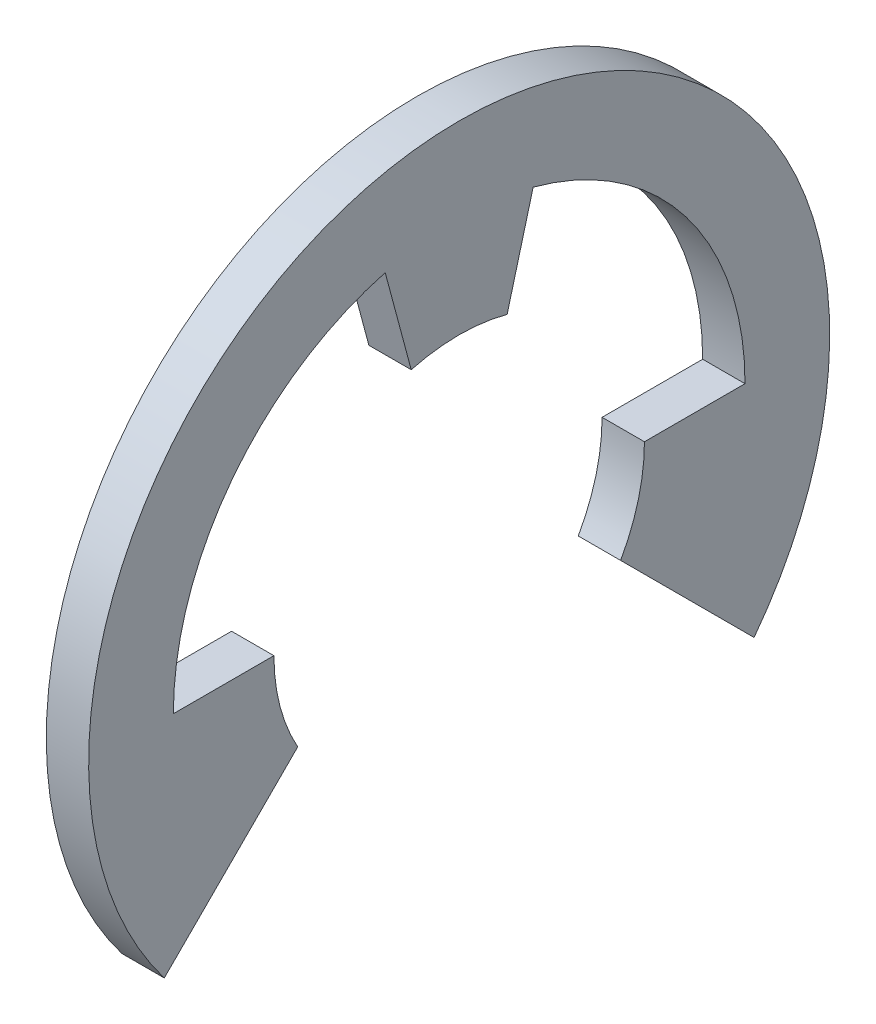
ISO-10303-21;
HEADER;
FILE_DESCRIPTION(('STEP AP214'),'2;1');
FILE_NAME('part.step','',(''),(''),'','','');
FILE_SCHEMA(('AUTOMOTIVE_DESIGN { 1 0 10303 214 1 1 1 1 }'));
ENDSEC;
DATA;
#1=APPLICATION_CONTEXT('core data for automotive mechanical design processes');
#2=APPLICATION_PROTOCOL_DEFINITION('international standard','automotive_design',2000,#1);
#3=PRODUCT_CONTEXT('',#1,'mechanical');
#4=PRODUCT('Part','Part','',(#3));
#5=PRODUCT_RELATED_PRODUCT_CATEGORY('part','',(#4));
#6=PRODUCT_DEFINITION_FORMATION('','',#4);
#7=PRODUCT_DEFINITION_CONTEXT('part definition',#1,'design');
#8=PRODUCT_DEFINITION('design','',#6,#7);
#9=PRODUCT_DEFINITION_SHAPE('','',#8);
#10=(LENGTH_UNIT() NAMED_UNIT(*) SI_UNIT(.MILLI.,.METRE.));
#11=(NAMED_UNIT(*) PLANE_ANGLE_UNIT() SI_UNIT($,.RADIAN.));
#12=(NAMED_UNIT(*) SI_UNIT($,.STERADIAN.) SOLID_ANGLE_UNIT());
#13=UNCERTAINTY_MEASURE_WITH_UNIT(LENGTH_MEASURE(1.E-05),#10,'distance_accuracy_value','');
#14=(GEOMETRIC_REPRESENTATION_CONTEXT(3) GLOBAL_UNCERTAINTY_ASSIGNED_CONTEXT((#13)) GLOBAL_UNIT_ASSIGNED_CONTEXT((#10,
#11,#12)) REPRESENTATION_CONTEXT('',''));
#15=CARTESIAN_POINT('',(0.,0.,0.));
#16=DIRECTION('',(0.,0.,1.));
#17=DIRECTION('',(1.,0.,0.));
#18=AXIS2_PLACEMENT_3D('',#15,#16,#17);
#19=CARTESIAN_POINT('',(0.8,0.,0.));
#20=DIRECTION('',(-1.,0.,0.));
#21=DIRECTION('',(0.,0.,1.));
#22=AXIS2_PLACEMENT_3D('',#19,#20,#21);
#23=CYLINDRICAL_SURFACE('',#22,3.5);
#24=CARTESIAN_POINT('',(0.,0.,0.));
#25=DIRECTION('',(-1.,0.,0.));
#26=DIRECTION('',(0.,0.,-1.));
#27=AXIS2_PLACEMENT_3D('',#24,#25,#26);
#28=CIRCLE('',#27,3.5);
#29=CARTESIAN_POINT('',(0.,-1.71682847133894,3.05));
#30=VERTEX_POINT('',#29);
#31=CARTESIAN_POINT('',(0.,0.,3.5));
#32=VERTEX_POINT('',#31);
#33=EDGE_CURVE('E154',#30,#32,#28,.T.);
#34=ORIENTED_EDGE('',*,*,#33,.T.);
#35=DIRECTION('',(-1.,0.,0.));
#36=VECTOR('',#35,1.);
#37=CARTESIAN_POINT('',(0.8,0.,3.5));
#38=LINE('',#37,#36);
#39=CARTESIAN_POINT('',(0.8,0.,3.5));
#40=VERTEX_POINT('',#39);
#41=EDGE_CURVE('E11',#40,#32,#38,.T.);
#42=ORIENTED_EDGE('',*,*,#41,.F.);
#43=CARTESIAN_POINT('',(0.8,0.,0.));
#44=DIRECTION('',(-1.,0.,0.));
#45=DIRECTION('',(0.,0.,-1.));
#46=AXIS2_PLACEMENT_3D('',#43,#44,#45);
#47=CIRCLE('',#46,3.5);
#48=CARTESIAN_POINT('',(0.8,-1.71682847133894,3.05));
#49=VERTEX_POINT('',#48);
#50=EDGE_CURVE('E176',#49,#40,#47,.T.);
#51=ORIENTED_EDGE('',*,*,#50,.F.);
#52=DIRECTION('',(-1.,0.,0.));
#53=VECTOR('',#52,1.);
#54=CARTESIAN_POINT('',(0.8,-1.71682847133894,3.05));
#55=LINE('',#54,#53);
#56=EDGE_CURVE('E150',#49,#30,#55,.T.);
#57=ORIENTED_EDGE('',*,*,#56,.T.);
#58=EDGE_LOOP('',(#34,#42,#51,#57));
#59=FACE_BOUND('',#58,.T.);
#60=ADVANCED_FACE('F34',(#59),#23,.F.);
#61=CARTESIAN_POINT('',(0.8,0.,3.5));
#62=DIRECTION('',(0.,-1.,0.));
#63=DIRECTION('',(0.,0.,-1.));
#64=AXIS2_PLACEMENT_3D('',#61,#62,#63);
#65=PLANE('',#64);
#66=DIRECTION('',(0.,0.,1.));
#67=VECTOR('',#66,1.);
#68=CARTESIAN_POINT('',(0.,0.,3.5));
#69=LINE('',#68,#67);
#70=CARTESIAN_POINT('',(0.,0.,5.4));
#71=VERTEX_POINT('',#70);
#72=EDGE_CURVE('E157',#32,#71,#69,.T.);
#73=ORIENTED_EDGE('',*,*,#72,.T.);
#74=DIRECTION('',(-1.,0.,0.));
#75=VECTOR('',#74,1.);
#76=CARTESIAN_POINT('',(0.8,0.,5.4));
#77=LINE('',#76,#75);
#78=CARTESIAN_POINT('',(0.8,0.,5.4));
#79=VERTEX_POINT('',#78);
#80=EDGE_CURVE('E42',#79,#71,#77,.T.);
#81=ORIENTED_EDGE('',*,*,#80,.F.);
#82=DIRECTION('',(0.,0.,1.));
#83=VECTOR('',#82,1.);
#84=CARTESIAN_POINT('',(0.8,0.,3.5));
#85=LINE('',#84,#83);
#86=EDGE_CURVE('E105',#40,#79,#85,.T.);
#87=ORIENTED_EDGE('',*,*,#86,.F.);
#88=ORIENTED_EDGE('',*,*,#41,.T.);
#89=EDGE_LOOP('',(#73,#81,#87,#88));
#90=FACE_BOUND('',#89,.T.);
#91=ADVANCED_FACE('F254',(#90),#65,.F.);
#92=CARTESIAN_POINT('',(0.8,0.,0.));
#93=DIRECTION('',(-1.,0.,0.));
#94=DIRECTION('',(0.,0.,1.));
#95=AXIS2_PLACEMENT_3D('',#92,#93,#94);
#96=CYLINDRICAL_SURFACE('',#95,5.4);
#97=CARTESIAN_POINT('',(0.,0.,0.));
#98=DIRECTION('',(-1.,0.,0.));
#99=DIRECTION('',(0.,0.,-1.));
#100=AXIS2_PLACEMENT_3D('',#97,#98,#99);
#101=CIRCLE('',#100,5.4);
#102=CARTESIAN_POINT('',(0.,5.21599946196095,1.39762284355368));
#103=VERTEX_POINT('',#102);
#104=EDGE_CURVE('E159',#71,#103,#101,.T.);
#105=ORIENTED_EDGE('',*,*,#104,.T.);
#106=DIRECTION('',(-1.,0.,0.));
#107=VECTOR('',#106,1.);
#108=CARTESIAN_POINT('',(0.8,5.21599946196095,1.39762284355368));
#109=LINE('',#108,#107);
#110=CARTESIAN_POINT('',(0.8,5.21599946196095,1.39762284355368));
#111=VERTEX_POINT('',#110);
#112=EDGE_CURVE('E195',#111,#103,#109,.T.);
#113=ORIENTED_EDGE('',*,*,#112,.F.);
#114=CARTESIAN_POINT('',(0.8,0.,0.));
#115=DIRECTION('',(-1.,0.,0.));
#116=DIRECTION('',(0.,0.,-1.));
#117=AXIS2_PLACEMENT_3D('',#114,#115,#116);
#118=CIRCLE('',#117,5.4);
#119=EDGE_CURVE('E203',#79,#111,#118,.T.);
#120=ORIENTED_EDGE('',*,*,#119,.F.);
#121=ORIENTED_EDGE('',*,*,#80,.T.);
#122=EDGE_LOOP('',(#105,#113,#120,#121));
#123=FACE_BOUND('',#122,.T.);
#124=ADVANCED_FACE('F201',(#123),#96,.F.);
#125=CARTESIAN_POINT('',(0.8,3.38074039201173,0.905866657858864));
#126=DIRECTION('',(0.,0.258819045102533,-0.965925826289065));
#127=DIRECTION('',(0.,0.965925826289065,0.258819045102533));
#128=AXIS2_PLACEMENT_3D('',#125,#126,#127);
#129=PLANE('',#128);
#130=DIRECTION('',(0.,-0.965925826289065,-0.258819045102533));
#131=VECTOR('',#130,1.);
#132=CARTESIAN_POINT('',(0.,3.38074039201173,0.905866657858864));
#133=LINE('',#132,#131);
#134=CARTESIAN_POINT('',(0.,3.38074039201173,0.905866657858864));
#135=VERTEX_POINT('',#134);
#136=EDGE_CURVE('E161',#103,#135,#133,.T.);
#137=ORIENTED_EDGE('',*,*,#136,.T.);
#138=DIRECTION('',(-1.,0.,0.));
#139=VECTOR('',#138,1.);
#140=CARTESIAN_POINT('',(0.8,3.38074039201173,0.905866657858864));
#141=LINE('',#140,#139);
#142=CARTESIAN_POINT('',(0.8,3.38074039201173,0.905866657858864));
#143=VERTEX_POINT('',#142);
#144=EDGE_CURVE('E192',#143,#135,#141,.T.);
#145=ORIENTED_EDGE('',*,*,#144,.F.);
#146=DIRECTION('',(0.,-0.965925826289065,-0.258819045102533));
#147=VECTOR('',#146,1.);
#148=CARTESIAN_POINT('',(0.8,3.38074039201173,0.905866657858864));
#149=LINE('',#148,#147);
#150=EDGE_CURVE('E221',#111,#143,#149,.T.);
#151=ORIENTED_EDGE('',*,*,#150,.F.);
#152=ORIENTED_EDGE('',*,*,#112,.T.);
#153=EDGE_LOOP('',(#137,#145,#151,#152));
#154=FACE_BOUND('',#153,.T.);
#155=ADVANCED_FACE('F212',(#154),#129,.F.);
#156=CARTESIAN_POINT('',(0.8,0.,0.));
#157=DIRECTION('',(-1.,0.,0.));
#158=DIRECTION('',(0.,0.,1.));
#159=AXIS2_PLACEMENT_3D('',#156,#157,#158);
#160=CYLINDRICAL_SURFACE('',#159,3.5);
#161=CARTESIAN_POINT('',(0.,0.,0.));
#162=DIRECTION('',(-1.,0.,0.));
#163=DIRECTION('',(0.,0.,-1.));
#164=AXIS2_PLACEMENT_3D('',#161,#162,#163);
#165=CIRCLE('',#164,3.5);
#166=CARTESIAN_POINT('',(0.,3.38074039201173,-0.905866657858864));
#167=VERTEX_POINT('',#166);
#168=EDGE_CURVE('E163',#135,#167,#165,.T.);
#169=ORIENTED_EDGE('',*,*,#168,.T.);
#170=DIRECTION('',(-1.,0.,0.));
#171=VECTOR('',#170,1.);
#172=CARTESIAN_POINT('',(0.8,3.38074039201173,-0.905866657858864));
#173=LINE('',#172,#171);
#174=CARTESIAN_POINT('',(0.8,3.38074039201173,-0.905866657858864));
#175=VERTEX_POINT('',#174);
#176=EDGE_CURVE('E189',#175,#167,#173,.T.);
#177=ORIENTED_EDGE('',*,*,#176,.F.);
#178=CARTESIAN_POINT('',(0.8,0.,0.));
#179=DIRECTION('',(-1.,0.,0.));
#180=DIRECTION('',(0.,0.,-1.));
#181=AXIS2_PLACEMENT_3D('',#178,#179,#180);
#182=CIRCLE('',#181,3.5);
#183=EDGE_CURVE('E218',#143,#175,#182,.T.);
#184=ORIENTED_EDGE('',*,*,#183,.F.);
#185=ORIENTED_EDGE('',*,*,#144,.T.);
#186=EDGE_LOOP('',(#169,#177,#184,#185));
#187=FACE_BOUND('',#186,.T.);
#188=ADVANCED_FACE('F216',(#187),#160,.F.);
#189=CARTESIAN_POINT('',(0.8,5.21599946196095,-1.39762284355368));
#190=DIRECTION('',(0.,0.258819045102533,0.965925826289065));
#191=DIRECTION('',(0.,-0.965925826289065,0.258819045102533));
#192=AXIS2_PLACEMENT_3D('',#189,#190,#191);
#193=PLANE('',#192);
#194=DIRECTION('',(0.,0.965925826289065,-0.258819045102533));
#195=VECTOR('',#194,1.);
#196=CARTESIAN_POINT('',(0.,5.21599946196095,-1.39762284355368));
#197=LINE('',#196,#195);
#198=CARTESIAN_POINT('',(0.,5.21599946196095,-1.39762284355368));
#199=VERTEX_POINT('',#198);
#200=EDGE_CURVE('E165',#167,#199,#197,.T.);
#201=ORIENTED_EDGE('',*,*,#200,.T.);
#202=DIRECTION('',(-1.,0.,0.));
#203=VECTOR('',#202,1.);
#204=CARTESIAN_POINT('',(0.8,5.21599946196095,-1.39762284355368));
#205=LINE('',#204,#203);
#206=CARTESIAN_POINT('',(0.8,5.21599946196095,-1.39762284355368));
#207=VERTEX_POINT('',#206);
#208=EDGE_CURVE('E186',#207,#199,#205,.T.);
#209=ORIENTED_EDGE('',*,*,#208,.F.);
#210=DIRECTION('',(0.,0.965925826289065,-0.258819045102533));
#211=VECTOR('',#210,1.);
#212=CARTESIAN_POINT('',(0.8,5.21599946196095,-1.39762284355368));
#213=LINE('',#212,#211);
#214=EDGE_CURVE('E220',#175,#207,#213,.T.);
#215=ORIENTED_EDGE('',*,*,#214,.F.);
#216=ORIENTED_EDGE('',*,*,#176,.T.);
#217=EDGE_LOOP('',(#201,#209,#215,#216));
#218=FACE_BOUND('',#217,.T.);
#219=ADVANCED_FACE('F267',(#218),#193,.F.);
#220=CARTESIAN_POINT('',(0.8,0.,0.));
#221=DIRECTION('',(-1.,0.,0.));
#222=DIRECTION('',(0.,0.,1.));
#223=AXIS2_PLACEMENT_3D('',#220,#221,#222);
#224=CYLINDRICAL_SURFACE('',#223,5.4);
#225=CARTESIAN_POINT('',(0.,0.,0.));
#226=DIRECTION('',(-1.,0.,0.));
#227=DIRECTION('',(0.,0.,-1.));
#228=AXIS2_PLACEMENT_3D('',#225,#226,#227);
#229=CIRCLE('',#228,5.4);
#230=CARTESIAN_POINT('',(0.,0.,-5.4));
#231=VERTEX_POINT('',#230);
#232=EDGE_CURVE('E167',#199,#231,#229,.T.);
#233=ORIENTED_EDGE('',*,*,#232,.T.);
#234=DIRECTION('',(-1.,0.,0.));
#235=VECTOR('',#234,1.);
#236=CARTESIAN_POINT('',(0.8,0.,-5.4));
#237=LINE('',#236,#235);
#238=CARTESIAN_POINT('',(0.8,0.,-5.4));
#239=VERTEX_POINT('',#238);
#240=EDGE_CURVE('E183',#239,#231,#237,.T.);
#241=ORIENTED_EDGE('',*,*,#240,.F.);
#242=CARTESIAN_POINT('',(0.8,0.,0.));
#243=DIRECTION('',(-1.,0.,0.));
#244=DIRECTION('',(0.,0.,-1.));
#245=AXIS2_PLACEMENT_3D('',#242,#243,#244);
#246=CIRCLE('',#245,5.4);
#247=EDGE_CURVE('E223',#207,#239,#246,.T.);
#248=ORIENTED_EDGE('',*,*,#247,.F.);
#249=ORIENTED_EDGE('',*,*,#208,.T.);
#250=EDGE_LOOP('',(#233,#241,#248,#249));
#251=FACE_BOUND('',#250,.T.);
#252=ADVANCED_FACE('F270',(#251),#224,.F.);
#253=CARTESIAN_POINT('',(0.8,0.,-3.5));
#254=DIRECTION('',(0.,-1.,0.));
#255=DIRECTION('',(0.,0.,-1.));
#256=AXIS2_PLACEMENT_3D('',#253,#254,#255);
#257=PLANE('',#256);
#258=DIRECTION('',(0.,0.,1.));
#259=VECTOR('',#258,1.);
#260=CARTESIAN_POINT('',(0.,0.,-3.5));
#261=LINE('',#260,#259);
#262=CARTESIAN_POINT('',(0.,0.,-3.5));
#263=VERTEX_POINT('',#262);
#264=EDGE_CURVE('E169',#231,#263,#261,.T.);
#265=ORIENTED_EDGE('',*,*,#264,.T.);
#266=DIRECTION('',(-1.,0.,0.));
#267=VECTOR('',#266,1.);
#268=CARTESIAN_POINT('',(0.8,0.,-3.5));
#269=LINE('',#268,#267);
#270=CARTESIAN_POINT('',(0.8,0.,-3.5));
#271=VERTEX_POINT('',#270);
#272=EDGE_CURVE('E180',#271,#263,#269,.T.);
#273=ORIENTED_EDGE('',*,*,#272,.F.);
#274=DIRECTION('',(0.,0.,1.));
#275=VECTOR('',#274,1.);
#276=CARTESIAN_POINT('',(0.8,0.,-3.5));
#277=LINE('',#276,#275);
#278=EDGE_CURVE('E229',#239,#271,#277,.T.);
#279=ORIENTED_EDGE('',*,*,#278,.F.);
#280=ORIENTED_EDGE('',*,*,#240,.T.);
#281=EDGE_LOOP('',(#265,#273,#279,#280));
#282=FACE_BOUND('',#281,.T.);
#283=ADVANCED_FACE('F235',(#282),#257,.F.);
#284=CARTESIAN_POINT('',(0.8,0.,0.));
#285=DIRECTION('',(-1.,0.,0.));
#286=DIRECTION('',(0.,0.,1.));
#287=AXIS2_PLACEMENT_3D('',#284,#285,#286);
#288=CYLINDRICAL_SURFACE('',#287,3.5);
#289=CARTESIAN_POINT('',(0.,0.,0.));
#290=DIRECTION('',(-1.,0.,0.));
#291=DIRECTION('',(0.,0.,-1.));
#292=AXIS2_PLACEMENT_3D('',#289,#290,#291);
#293=CIRCLE('',#292,3.5);
#294=CARTESIAN_POINT('',(0.,-1.71682847133894,-3.05));
#295=VERTEX_POINT('',#294);
#296=EDGE_CURVE('E171',#263,#295,#293,.T.);
#297=ORIENTED_EDGE('',*,*,#296,.T.);
#298=DIRECTION('',(-1.,0.,0.));
#299=VECTOR('',#298,1.);
#300=CARTESIAN_POINT('',(0.8,-1.71682847133894,-3.05));
#301=LINE('',#300,#299);
#302=CARTESIAN_POINT('',(0.8,-1.71682847133894,-3.05));
#303=VERTEX_POINT('',#302);
#304=EDGE_CURVE('E145',#303,#295,#301,.T.);
#305=ORIENTED_EDGE('',*,*,#304,.F.);
#306=CARTESIAN_POINT('',(0.8,0.,0.));
#307=DIRECTION('',(-1.,0.,0.));
#308=DIRECTION('',(0.,0.,-1.));
#309=AXIS2_PLACEMENT_3D('',#306,#307,#308);
#310=CIRCLE('',#309,3.5);
#311=EDGE_CURVE('E136',#271,#303,#310,.T.);
#312=ORIENTED_EDGE('',*,*,#311,.F.);
#313=ORIENTED_EDGE('',*,*,#272,.T.);
#314=EDGE_LOOP('',(#297,#305,#312,#313));
#315=FACE_BOUND('',#314,.T.);
#316=ADVANCED_FACE('F239',(#315),#288,.F.);
#317=CARTESIAN_POINT('',(0.8,-1.71682847133894,-3.05));
#318=DIRECTION('',(0.,0.707106781186548,-0.707106781186548));
#319=DIRECTION('',(0.,0.707106781186548,0.707106781186548));
#320=AXIS2_PLACEMENT_3D('',#317,#318,#319);
#321=PLANE('',#320);
#322=DIRECTION('',(0.,-0.707106781186547,-0.707106781186547));
#323=VECTOR('',#322,1.);
#324=CARTESIAN_POINT('',(0.,-1.71682847133894,-3.05));
#325=LINE('',#324,#323);
#326=CARTESIAN_POINT('',(0.,-4.23807155487046,-5.57124308353152));
#327=VERTEX_POINT('',#326);
#328=EDGE_CURVE('E144',#295,#327,#325,.T.);
#329=ORIENTED_EDGE('',*,*,#328,.T.);
#330=DIRECTION('',(-1.,0.,0.));
#331=VECTOR('',#330,1.);
#332=CARTESIAN_POINT('',(0.8,-4.23807155487046,-5.57124308353152));
#333=LINE('',#332,#331);
#334=CARTESIAN_POINT('',(0.8,-4.23807155487046,-5.57124308353152));
#335=VERTEX_POINT('',#334);
#336=EDGE_CURVE('E141',#335,#327,#333,.T.);
#337=ORIENTED_EDGE('',*,*,#336,.F.);
#338=DIRECTION('',(0.,-0.707106781186547,-0.707106781186547));
#339=VECTOR('',#338,1.);
#340=CARTESIAN_POINT('',(0.8,-1.71682847133894,-3.05));
#341=LINE('',#340,#339);
#342=EDGE_CURVE('E130',#303,#335,#341,.T.);
#343=ORIENTED_EDGE('',*,*,#342,.F.);
#344=ORIENTED_EDGE('',*,*,#304,.T.);
#345=EDGE_LOOP('',(#329,#337,#343,#344));
#346=FACE_BOUND('',#345,.T.);
#347=ADVANCED_FACE('F142',(#346),#321,.F.);
#348=CARTESIAN_POINT('',(0.8,0.,0.));
#349=DIRECTION('',(-1.,0.,0.));
#350=DIRECTION('',(0.,0.,1.));
#351=AXIS2_PLACEMENT_3D('',#348,#349,#350);
#352=CYLINDRICAL_SURFACE('',#351,7.);
#353=CARTESIAN_POINT('',(0.,0.,0.));
#354=DIRECTION('',(1.,0.,0.));
#355=DIRECTION('',(0.,0.,-1.));
#356=AXIS2_PLACEMENT_3D('',#353,#354,#355);
#357=CIRCLE('',#356,7.);
#358=CARTESIAN_POINT('',(0.,-4.23807155487046,5.57124308353152));
#359=VERTEX_POINT('',#358);
#360=EDGE_CURVE('E91',#327,#359,#357,.T.);
#361=ORIENTED_EDGE('',*,*,#360,.T.);
#362=DIRECTION('',(-1.,0.,0.));
#363=VECTOR('',#362,1.);
#364=CARTESIAN_POINT('',(0.8,-4.23807155487046,5.57124308353152));
#365=LINE('',#364,#363);
#366=CARTESIAN_POINT('',(0.8,-4.23807155487046,5.57124308353152));
#367=VERTEX_POINT('',#366);
#368=EDGE_CURVE('E146',#367,#359,#365,.T.);
#369=ORIENTED_EDGE('',*,*,#368,.F.);
#370=CARTESIAN_POINT('',(0.8,0.,0.));
#371=DIRECTION('',(1.,0.,0.));
#372=DIRECTION('',(0.,0.,-1.));
#373=AXIS2_PLACEMENT_3D('',#370,#371,#372);
#374=CIRCLE('',#373,7.);
#375=EDGE_CURVE('E134',#335,#367,#374,.T.);
#376=ORIENTED_EDGE('',*,*,#375,.F.);
#377=ORIENTED_EDGE('',*,*,#336,.T.);
#378=EDGE_LOOP('',(#361,#369,#376,#377));
#379=FACE_BOUND('',#378,.T.);
#380=ADVANCED_FACE('F148',(#379),#352,.T.);
#381=CARTESIAN_POINT('',(0.8,-1.71682847133894,3.05));
#382=DIRECTION('',(0.,0.707106781186548,0.707106781186548));
#383=DIRECTION('',(0.,-0.707106781186548,0.707106781186548));
#384=AXIS2_PLACEMENT_3D('',#381,#382,#383);
#385=PLANE('',#384);
#386=DIRECTION('',(0.,0.707106781186547,-0.707106781186547));
#387=VECTOR('',#386,1.);
#388=CARTESIAN_POINT('',(0.,-1.71682847133894,3.05));
#389=LINE('',#388,#387);
#390=EDGE_CURVE('E97',#359,#30,#389,.T.);
#391=ORIENTED_EDGE('',*,*,#390,.T.);
#392=ORIENTED_EDGE('',*,*,#56,.F.);
#393=DIRECTION('',(0.,0.707106781186547,-0.707106781186547));
#394=VECTOR('',#393,1.);
#395=CARTESIAN_POINT('',(0.8,-1.71682847133894,3.05));
#396=LINE('',#395,#394);
#397=EDGE_CURVE('E50',#367,#49,#396,.T.);
#398=ORIENTED_EDGE('',*,*,#397,.F.);
#399=ORIENTED_EDGE('',*,*,#368,.T.);
#400=EDGE_LOOP('',(#391,#392,#398,#399));
#401=FACE_BOUND('',#400,.T.);
#402=ADVANCED_FACE('F243',(#401),#385,.F.);
#403=CARTESIAN_POINT('',(0.8,0.,0.));
#404=DIRECTION('',(1.,0.,0.));
#405=DIRECTION('',(0.,0.,-1.));
#406=AXIS2_PLACEMENT_3D('',#403,#404,#405);
#407=PLANE('',#406);
#408=ORIENTED_EDGE('',*,*,#50,.T.);
#409=ORIENTED_EDGE('',*,*,#86,.T.);
#410=ORIENTED_EDGE('',*,*,#119,.T.);
#411=ORIENTED_EDGE('',*,*,#150,.T.);
#412=ORIENTED_EDGE('',*,*,#183,.T.);
#413=ORIENTED_EDGE('',*,*,#214,.T.);
#414=ORIENTED_EDGE('',*,*,#247,.T.);
#415=ORIENTED_EDGE('',*,*,#278,.T.);
#416=ORIENTED_EDGE('',*,*,#311,.T.);
#417=ORIENTED_EDGE('',*,*,#342,.T.);
#418=ORIENTED_EDGE('',*,*,#375,.T.);
#419=ORIENTED_EDGE('',*,*,#397,.T.);
#420=EDGE_LOOP('',(#408,#409,#410,#411,#412,#413,#414,#415,#416,#417,#418,#419));
#421=FACE_BOUND('',#420,.T.);
#422=ADVANCED_FACE('F132',(#421),#407,.T.);
#423=CARTESIAN_POINT('',(0.,0.,0.));
#424=DIRECTION('',(1.,0.,0.));
#425=DIRECTION('',(0.,0.,-1.));
#426=AXIS2_PLACEMENT_3D('',#423,#424,#425);
#427=PLANE('',#426);
#428=ORIENTED_EDGE('',*,*,#33,.F.);
#429=ORIENTED_EDGE('',*,*,#390,.F.);
#430=ORIENTED_EDGE('',*,*,#360,.F.);
#431=ORIENTED_EDGE('',*,*,#328,.F.);
#432=ORIENTED_EDGE('',*,*,#296,.F.);
#433=ORIENTED_EDGE('',*,*,#264,.F.);
#434=ORIENTED_EDGE('',*,*,#232,.F.);
#435=ORIENTED_EDGE('',*,*,#200,.F.);
#436=ORIENTED_EDGE('',*,*,#168,.F.);
#437=ORIENTED_EDGE('',*,*,#136,.F.);
#438=ORIENTED_EDGE('',*,*,#104,.F.);
#439=ORIENTED_EDGE('',*,*,#72,.F.);
#440=EDGE_LOOP('',(#428,#429,#430,#431,#432,#433,#434,#435,#436,#437,#438,#439));
#441=FACE_BOUND('',#440,.T.);
#442=ADVANCED_FACE('F207',(#441),#427,.F.);
#443=CLOSED_SHELL('',(#60,#91,#124,#155,#188,#219,#252,#283,#316,#347,#380,#402,#422,#442));
#444=MANIFOLD_SOLID_BREP('B2',#443);
#445=ADVANCED_BREP_SHAPE_REPRESENTATION('',(#18,#444),#14);
#446=SHAPE_DEFINITION_REPRESENTATION(#9,#445);
ENDSEC;
END-ISO-10303-21;
